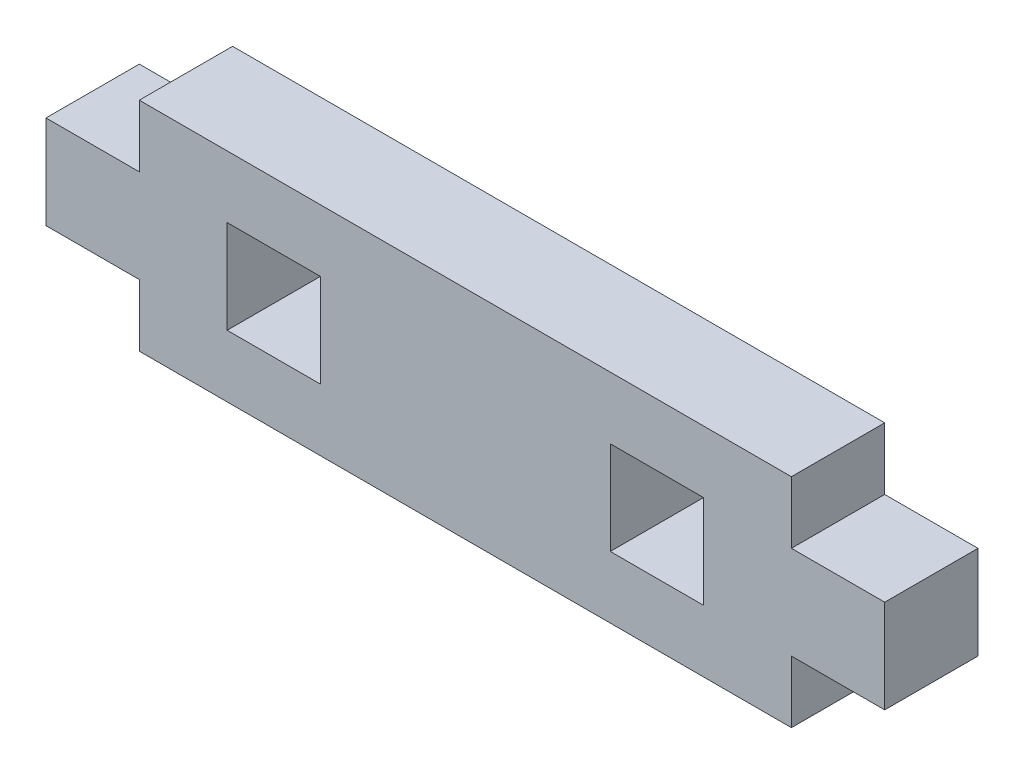
ISO-10303-21;
HEADER;
FILE_DESCRIPTION(('STEP AP214'),'2;1');
FILE_NAME('part.step','',(''),(''),'','','');
FILE_SCHEMA(('AUTOMOTIVE_DESIGN { 1 0 10303 214 1 1 1 1 }'));
ENDSEC;
DATA;
#1=APPLICATION_CONTEXT('core data for automotive mechanical design processes');
#2=APPLICATION_PROTOCOL_DEFINITION('international standard','automotive_design',2000,#1);
#3=PRODUCT_CONTEXT('',#1,'mechanical');
#4=PRODUCT('Part','Part','',(#3));
#5=PRODUCT_RELATED_PRODUCT_CATEGORY('part','',(#4));
#6=PRODUCT_DEFINITION_FORMATION('','',#4);
#7=PRODUCT_DEFINITION_CONTEXT('part definition',#1,'design');
#8=PRODUCT_DEFINITION('design','',#6,#7);
#9=PRODUCT_DEFINITION_SHAPE('','',#8);
#10=(LENGTH_UNIT() NAMED_UNIT(*) SI_UNIT(.MILLI.,.METRE.));
#11=(NAMED_UNIT(*) PLANE_ANGLE_UNIT() SI_UNIT($,.RADIAN.));
#12=(NAMED_UNIT(*) SI_UNIT($,.STERADIAN.) SOLID_ANGLE_UNIT());
#13=UNCERTAINTY_MEASURE_WITH_UNIT(LENGTH_MEASURE(1.E-05),#10,'distance_accuracy_value','');
#14=(GEOMETRIC_REPRESENTATION_CONTEXT(3) GLOBAL_UNCERTAINTY_ASSIGNED_CONTEXT((#13)) GLOBAL_UNIT_ASSIGNED_CONTEXT((#10,
#11,#12)) REPRESENTATION_CONTEXT('',''));
#15=CARTESIAN_POINT('',(0.,0.,0.));
#16=DIRECTION('',(0.,0.,1.));
#17=DIRECTION('',(1.,0.,0.));
#18=AXIS2_PLACEMENT_3D('',#15,#16,#17);
#19=CARTESIAN_POINT('',(5.15,3.425,5.15));
#20=DIRECTION('',(0.,1.,0.));
#21=DIRECTION('',(-1.,0.,0.));
#22=AXIS2_PLACEMENT_3D('',#19,#20,#21);
#23=PLANE('',#22);
#24=DIRECTION('',(1.,0.,0.));
#25=VECTOR('',#24,1.);
#26=CARTESIAN_POINT('',(5.15,3.425,0.));
#27=LINE('',#26,#25);
#28=CARTESIAN_POINT('',(0.,3.425,0.));
#29=VERTEX_POINT('',#28);
#30=CARTESIAN_POINT('',(5.15,3.425,0.));
#31=VERTEX_POINT('',#30);
#32=EDGE_CURVE('E231',#29,#31,#27,.T.);
#33=ORIENTED_EDGE('',*,*,#32,.T.);
#34=DIRECTION('',(0.,0.,-1.));
#35=VECTOR('',#34,1.);
#36=CARTESIAN_POINT('',(5.15,3.425,5.15));
#37=LINE('',#36,#35);
#38=CARTESIAN_POINT('',(5.15,3.425,5.15));
#39=VERTEX_POINT('',#38);
#40=EDGE_CURVE('E11',#39,#31,#37,.T.);
#41=ORIENTED_EDGE('',*,*,#40,.F.);
#42=DIRECTION('',(1.,0.,0.));
#43=VECTOR('',#42,1.);
#44=CARTESIAN_POINT('',(5.15,3.425,5.15));
#45=LINE('',#44,#43);
#46=CARTESIAN_POINT('',(0.,3.425,5.15));
#47=VERTEX_POINT('',#46);
#48=EDGE_CURVE('E238',#47,#39,#45,.T.);
#49=ORIENTED_EDGE('',*,*,#48,.F.);
#50=DIRECTION('',(0.,0.,-1.));
#51=VECTOR('',#50,1.);
#52=CARTESIAN_POINT('',(0.,3.425,5.15));
#53=LINE('',#52,#51);
#54=EDGE_CURVE('E264',#47,#29,#53,.T.);
#55=ORIENTED_EDGE('',*,*,#54,.T.);
#56=EDGE_LOOP('',(#33,#41,#49,#55));
#57=FACE_BOUND('',#56,.T.);
#58=ADVANCED_FACE('F33',(#57),#23,.F.);
#59=CARTESIAN_POINT('',(5.15,0.,5.15));
#60=DIRECTION('',(1.,0.,0.));
#61=DIRECTION('',(0.,1.,0.));
#62=AXIS2_PLACEMENT_3D('',#59,#60,#61);
#63=PLANE('',#62);
#64=DIRECTION('',(0.,-1.,0.));
#65=VECTOR('',#64,1.);
#66=CARTESIAN_POINT('',(5.15,0.,0.));
#67=LINE('',#66,#65);
#68=CARTESIAN_POINT('',(5.15,0.,0.));
#69=VERTEX_POINT('',#68);
#70=EDGE_CURVE('E267',#31,#69,#67,.T.);
#71=ORIENTED_EDGE('',*,*,#70,.T.);
#72=DIRECTION('',(0.,0.,-1.));
#73=VECTOR('',#72,1.);
#74=CARTESIAN_POINT('',(5.15,0.,5.15));
#75=LINE('',#74,#73);
#76=CARTESIAN_POINT('',(5.15,0.,5.15));
#77=VERTEX_POINT('',#76);
#78=EDGE_CURVE('E40',#77,#69,#75,.T.);
#79=ORIENTED_EDGE('',*,*,#78,.F.);
#80=DIRECTION('',(0.,-1.,0.));
#81=VECTOR('',#80,1.);
#82=CARTESIAN_POINT('',(5.15,0.,5.15));
#83=LINE('',#82,#81);
#84=EDGE_CURVE('E241',#39,#77,#83,.T.);
#85=ORIENTED_EDGE('',*,*,#84,.F.);
#86=ORIENTED_EDGE('',*,*,#40,.T.);
#87=EDGE_LOOP('',(#71,#79,#85,#86));
#88=FACE_BOUND('',#87,.T.);
#89=ADVANCED_FACE('F343',(#88),#63,.F.);
#90=CARTESIAN_POINT('',(5.15,0.,5.15));
#91=DIRECTION('',(0.,1.,0.));
#92=DIRECTION('',(0.,0.,1.));
#93=AXIS2_PLACEMENT_3D('',#90,#91,#92);
#94=PLANE('',#93);
#95=DIRECTION('',(1.,0.,0.));
#96=VECTOR('',#95,1.);
#97=CARTESIAN_POINT('',(5.15,0.,0.));
#98=LINE('',#97,#96);
#99=CARTESIAN_POINT('',(41.15,0.,0.));
#100=VERTEX_POINT('',#99);
#101=EDGE_CURVE('E269',#69,#100,#98,.T.);
#102=ORIENTED_EDGE('',*,*,#101,.T.);
#103=DIRECTION('',(0.,0.,-1.));
#104=VECTOR('',#103,1.);
#105=CARTESIAN_POINT('',(41.15,0.,5.15));
#106=LINE('',#105,#104);
#107=CARTESIAN_POINT('',(41.15,0.,5.15));
#108=VERTEX_POINT('',#107);
#109=EDGE_CURVE('E314',#108,#100,#106,.T.);
#110=ORIENTED_EDGE('',*,*,#109,.F.);
#111=DIRECTION('',(1.,0.,0.));
#112=VECTOR('',#111,1.);
#113=CARTESIAN_POINT('',(5.15,0.,5.15));
#114=LINE('',#113,#112);
#115=EDGE_CURVE('E244',#77,#108,#114,.T.);
#116=ORIENTED_EDGE('',*,*,#115,.F.);
#117=ORIENTED_EDGE('',*,*,#78,.T.);
#118=EDGE_LOOP('',(#102,#110,#116,#117));
#119=FACE_BOUND('',#118,.T.);
#120=ADVANCED_FACE('F321',(#119),#94,.F.);
#121=CARTESIAN_POINT('',(41.15,0.,5.15));
#122=DIRECTION('',(-1.,0.,0.));
#123=DIRECTION('',(0.,0.,1.));
#124=AXIS2_PLACEMENT_3D('',#121,#122,#123);
#125=PLANE('',#124);
#126=DIRECTION('',(0.,1.,0.));
#127=VECTOR('',#126,1.);
#128=CARTESIAN_POINT('',(41.15,0.,0.));
#129=LINE('',#128,#127);
#130=CARTESIAN_POINT('',(41.15,3.425,0.));
#131=VERTEX_POINT('',#130);
#132=EDGE_CURVE('E271',#100,#131,#129,.T.);
#133=ORIENTED_EDGE('',*,*,#132,.T.);
#134=DIRECTION('',(0.,0.,-1.));
#135=VECTOR('',#134,1.);
#136=CARTESIAN_POINT('',(41.15,3.425,5.15));
#137=LINE('',#136,#135);
#138=CARTESIAN_POINT('',(41.15,3.425,5.15));
#139=VERTEX_POINT('',#138);
#140=EDGE_CURVE('E311',#139,#131,#137,.T.);
#141=ORIENTED_EDGE('',*,*,#140,.F.);
#142=DIRECTION('',(0.,1.,0.));
#143=VECTOR('',#142,1.);
#144=CARTESIAN_POINT('',(41.15,0.,5.15));
#145=LINE('',#144,#143);
#146=EDGE_CURVE('E246',#108,#139,#145,.T.);
#147=ORIENTED_EDGE('',*,*,#146,.F.);
#148=ORIENTED_EDGE('',*,*,#109,.T.);
#149=EDGE_LOOP('',(#133,#141,#147,#148));
#150=FACE_BOUND('',#149,.T.);
#151=ADVANCED_FACE('F331',(#150),#125,.F.);
#152=CARTESIAN_POINT('',(46.3,3.425,5.15));
#153=DIRECTION('',(0.,1.,0.));
#154=DIRECTION('',(0.,0.,1.));
#155=AXIS2_PLACEMENT_3D('',#152,#153,#154);
#156=PLANE('',#155);
#157=DIRECTION('',(1.,0.,0.));
#158=VECTOR('',#157,1.);
#159=CARTESIAN_POINT('',(46.3,3.425,0.));
#160=LINE('',#159,#158);
#161=CARTESIAN_POINT('',(46.3,3.425,0.));
#162=VERTEX_POINT('',#161);
#163=EDGE_CURVE('E273',#131,#162,#160,.T.);
#164=ORIENTED_EDGE('',*,*,#163,.T.);
#165=DIRECTION('',(0.,0.,-1.));
#166=VECTOR('',#165,1.);
#167=CARTESIAN_POINT('',(46.3,3.425,5.15));
#168=LINE('',#167,#166);
#169=CARTESIAN_POINT('',(46.3,3.425,5.15));
#170=VERTEX_POINT('',#169);
#171=EDGE_CURVE('E308',#170,#162,#168,.T.);
#172=ORIENTED_EDGE('',*,*,#171,.F.);
#173=DIRECTION('',(1.,0.,0.));
#174=VECTOR('',#173,1.);
#175=CARTESIAN_POINT('',(46.3,3.425,5.15));
#176=LINE('',#175,#174);
#177=EDGE_CURVE('E248',#139,#170,#176,.T.);
#178=ORIENTED_EDGE('',*,*,#177,.F.);
#179=ORIENTED_EDGE('',*,*,#140,.T.);
#180=EDGE_LOOP('',(#164,#172,#178,#179));
#181=FACE_BOUND('',#180,.T.);
#182=ADVANCED_FACE('F335',(#181),#156,.F.);
#183=CARTESIAN_POINT('',(46.3,8.575,5.15));
#184=DIRECTION('',(-1.,0.,0.));
#185=DIRECTION('',(0.,0.,1.));
#186=AXIS2_PLACEMENT_3D('',#183,#184,#185);
#187=PLANE('',#186);
#188=DIRECTION('',(0.,1.,0.));
#189=VECTOR('',#188,1.);
#190=CARTESIAN_POINT('',(46.3,8.575,0.));
#191=LINE('',#190,#189);
#192=CARTESIAN_POINT('',(46.3,8.575,0.));
#193=VERTEX_POINT('',#192);
#194=EDGE_CURVE('E275',#162,#193,#191,.T.);
#195=ORIENTED_EDGE('',*,*,#194,.T.);
#196=DIRECTION('',(0.,0.,-1.));
#197=VECTOR('',#196,1.);
#198=CARTESIAN_POINT('',(46.3,8.575,5.15));
#199=LINE('',#198,#197);
#200=CARTESIAN_POINT('',(46.3,8.575,5.15));
#201=VERTEX_POINT('',#200);
#202=EDGE_CURVE('E305',#201,#193,#199,.T.);
#203=ORIENTED_EDGE('',*,*,#202,.F.);
#204=DIRECTION('',(0.,1.,0.));
#205=VECTOR('',#204,1.);
#206=CARTESIAN_POINT('',(46.3,8.575,5.15));
#207=LINE('',#206,#205);
#208=EDGE_CURVE('E250',#170,#201,#207,.T.);
#209=ORIENTED_EDGE('',*,*,#208,.F.);
#210=ORIENTED_EDGE('',*,*,#171,.T.);
#211=EDGE_LOOP('',(#195,#203,#209,#210));
#212=FACE_BOUND('',#211,.T.);
#213=ADVANCED_FACE('F376',(#212),#187,.F.);
#214=CARTESIAN_POINT('',(41.15,8.575,5.15));
#215=DIRECTION('',(0.,-1.,0.));
#216=DIRECTION('',(1.,0.,0.));
#217=AXIS2_PLACEMENT_3D('',#214,#215,#216);
#218=PLANE('',#217);
#219=DIRECTION('',(-1.,0.,0.));
#220=VECTOR('',#219,1.);
#221=CARTESIAN_POINT('',(41.15,8.575,0.));
#222=LINE('',#221,#220);
#223=CARTESIAN_POINT('',(41.15,8.575,0.));
#224=VERTEX_POINT('',#223);
#225=EDGE_CURVE('E277',#193,#224,#222,.T.);
#226=ORIENTED_EDGE('',*,*,#225,.T.);
#227=DIRECTION('',(0.,0.,-1.));
#228=VECTOR('',#227,1.);
#229=CARTESIAN_POINT('',(41.15,8.575,5.15));
#230=LINE('',#229,#228);
#231=CARTESIAN_POINT('',(41.15,8.575,5.15));
#232=VERTEX_POINT('',#231);
#233=EDGE_CURVE('E302',#232,#224,#230,.T.);
#234=ORIENTED_EDGE('',*,*,#233,.F.);
#235=DIRECTION('',(-1.,0.,0.));
#236=VECTOR('',#235,1.);
#237=CARTESIAN_POINT('',(41.15,8.575,5.15));
#238=LINE('',#237,#236);
#239=EDGE_CURVE('E252',#201,#232,#238,.T.);
#240=ORIENTED_EDGE('',*,*,#239,.F.);
#241=ORIENTED_EDGE('',*,*,#202,.T.);
#242=EDGE_LOOP('',(#226,#234,#240,#241));
#243=FACE_BOUND('',#242,.T.);
#244=ADVANCED_FACE('F374',(#243),#218,.F.);
#245=CARTESIAN_POINT('',(41.15,8.575,5.15));
#246=DIRECTION('',(-1.,0.,0.));
#247=DIRECTION('',(0.,0.,1.));
#248=AXIS2_PLACEMENT_3D('',#245,#246,#247);
#249=PLANE('',#248);
#250=DIRECTION('',(0.,1.,0.));
#251=VECTOR('',#250,1.);
#252=CARTESIAN_POINT('',(41.15,8.575,0.));
#253=LINE('',#252,#251);
#254=CARTESIAN_POINT('',(41.15,12.,0.));
#255=VERTEX_POINT('',#254);
#256=EDGE_CURVE('E279',#224,#255,#253,.T.);
#257=ORIENTED_EDGE('',*,*,#256,.T.);
#258=DIRECTION('',(0.,0.,-1.));
#259=VECTOR('',#258,1.);
#260=CARTESIAN_POINT('',(41.15,12.,5.15));
#261=LINE('',#260,#259);
#262=CARTESIAN_POINT('',(41.15,12.,5.15));
#263=VERTEX_POINT('',#262);
#264=EDGE_CURVE('E299',#263,#255,#261,.T.);
#265=ORIENTED_EDGE('',*,*,#264,.F.);
#266=DIRECTION('',(0.,1.,0.));
#267=VECTOR('',#266,1.);
#268=CARTESIAN_POINT('',(41.15,8.575,5.15));
#269=LINE('',#268,#267);
#270=EDGE_CURVE('E254',#232,#263,#269,.T.);
#271=ORIENTED_EDGE('',*,*,#270,.F.);
#272=ORIENTED_EDGE('',*,*,#233,.T.);
#273=EDGE_LOOP('',(#257,#265,#271,#272));
#274=FACE_BOUND('',#273,.T.);
#275=ADVANCED_FACE('F370',(#274),#249,.F.);
#276=CARTESIAN_POINT('',(41.15,12.,5.15));
#277=DIRECTION('',(0.,-1.,0.));
#278=DIRECTION('',(0.,0.,-1.));
#279=AXIS2_PLACEMENT_3D('',#276,#277,#278);
#280=PLANE('',#279);
#281=DIRECTION('',(-1.,0.,0.));
#282=VECTOR('',#281,1.);
#283=CARTESIAN_POINT('',(41.15,12.,0.));
#284=LINE('',#283,#282);
#285=CARTESIAN_POINT('',(5.15000000000002,12.,0.));
#286=VERTEX_POINT('',#285);
#287=EDGE_CURVE('E281',#255,#286,#284,.T.);
#288=ORIENTED_EDGE('',*,*,#287,.T.);
#289=DIRECTION('',(0.,0.,-1.));
#290=VECTOR('',#289,1.);
#291=CARTESIAN_POINT('',(5.15000000000002,12.,5.15));
#292=LINE('',#291,#290);
#293=CARTESIAN_POINT('',(5.15000000000002,12.,5.15));
#294=VERTEX_POINT('',#293);
#295=EDGE_CURVE('E296',#294,#286,#292,.T.);
#296=ORIENTED_EDGE('',*,*,#295,.F.);
#297=DIRECTION('',(-1.,0.,0.));
#298=VECTOR('',#297,1.);
#299=CARTESIAN_POINT('',(41.15,12.,5.15));
#300=LINE('',#299,#298);
#301=EDGE_CURVE('E256',#263,#294,#300,.T.);
#302=ORIENTED_EDGE('',*,*,#301,.F.);
#303=ORIENTED_EDGE('',*,*,#264,.T.);
#304=EDGE_LOOP('',(#288,#296,#302,#303));
#305=FACE_BOUND('',#304,.T.);
#306=ADVANCED_FACE('F365',(#305),#280,.F.);
#307=CARTESIAN_POINT('',(5.15,8.575,5.15));
#308=DIRECTION('',(1.,0.,0.));
#309=DIRECTION('',(0.,1.,0.));
#310=AXIS2_PLACEMENT_3D('',#307,#308,#309);
#311=PLANE('',#310);
#312=DIRECTION('',(0.,-1.,0.));
#313=VECTOR('',#312,1.);
#314=CARTESIAN_POINT('',(5.15,8.575,0.));
#315=LINE('',#314,#313);
#316=CARTESIAN_POINT('',(5.15,8.575,0.));
#317=VERTEX_POINT('',#316);
#318=EDGE_CURVE('E283',#286,#317,#315,.T.);
#319=ORIENTED_EDGE('',*,*,#318,.T.);
#320=DIRECTION('',(0.,0.,-1.));
#321=VECTOR('',#320,1.);
#322=CARTESIAN_POINT('',(5.15,8.575,5.15));
#323=LINE('',#322,#321);
#324=CARTESIAN_POINT('',(5.15,8.575,5.15));
#325=VERTEX_POINT('',#324);
#326=EDGE_CURVE('E293',#325,#317,#323,.T.);
#327=ORIENTED_EDGE('',*,*,#326,.F.);
#328=DIRECTION('',(0.,-1.,0.));
#329=VECTOR('',#328,1.);
#330=CARTESIAN_POINT('',(5.15,8.575,5.15));
#331=LINE('',#330,#329);
#332=EDGE_CURVE('E258',#294,#325,#331,.T.);
#333=ORIENTED_EDGE('',*,*,#332,.F.);
#334=ORIENTED_EDGE('',*,*,#295,.T.);
#335=EDGE_LOOP('',(#319,#327,#333,#334));
#336=FACE_BOUND('',#335,.T.);
#337=ADVANCED_FACE('F359',(#336),#311,.F.);
#338=CARTESIAN_POINT('',(0.,8.575,5.15));
#339=DIRECTION('',(0.,-1.,0.));
#340=DIRECTION('',(0.,0.,-1.));
#341=AXIS2_PLACEMENT_3D('',#338,#339,#340);
#342=PLANE('',#341);
#343=DIRECTION('',(-1.,0.,0.));
#344=VECTOR('',#343,1.);
#345=CARTESIAN_POINT('',(0.,8.575,0.));
#346=LINE('',#345,#344);
#347=CARTESIAN_POINT('',(0.,8.575,0.));
#348=VERTEX_POINT('',#347);
#349=EDGE_CURVE('E285',#317,#348,#346,.T.);
#350=ORIENTED_EDGE('',*,*,#349,.T.);
#351=DIRECTION('',(0.,0.,-1.));
#352=VECTOR('',#351,1.);
#353=CARTESIAN_POINT('',(0.,8.575,5.15));
#354=LINE('',#353,#352);
#355=CARTESIAN_POINT('',(0.,8.575,5.15));
#356=VERTEX_POINT('',#355);
#357=EDGE_CURVE('E290',#356,#348,#354,.T.);
#358=ORIENTED_EDGE('',*,*,#357,.F.);
#359=DIRECTION('',(-1.,0.,0.));
#360=VECTOR('',#359,1.);
#361=CARTESIAN_POINT('',(0.,8.575,5.15));
#362=LINE('',#361,#360);
#363=EDGE_CURVE('E260',#325,#356,#362,.T.);
#364=ORIENTED_EDGE('',*,*,#363,.F.);
#365=ORIENTED_EDGE('',*,*,#326,.T.);
#366=EDGE_LOOP('',(#350,#358,#364,#365));
#367=FACE_BOUND('',#366,.T.);
#368=ADVANCED_FACE('F355',(#367),#342,.F.);
#369=CARTESIAN_POINT('',(0.,3.425,5.15));
#370=DIRECTION('',(1.,0.,0.));
#371=DIRECTION('',(0.,1.,0.));
#372=AXIS2_PLACEMENT_3D('',#369,#370,#371);
#373=PLANE('',#372);
#374=DIRECTION('',(0.,-1.,0.));
#375=VECTOR('',#374,1.);
#376=CARTESIAN_POINT('',(0.,3.425,0.));
#377=LINE('',#376,#375);
#378=EDGE_CURVE('E242',#348,#29,#377,.T.);
#379=ORIENTED_EDGE('',*,*,#378,.T.);
#380=ORIENTED_EDGE('',*,*,#54,.F.);
#381=DIRECTION('',(0.,-1.,0.));
#382=VECTOR('',#381,1.);
#383=CARTESIAN_POINT('',(0.,3.425,5.15));
#384=LINE('',#383,#382);
#385=EDGE_CURVE('E262',#356,#47,#384,.T.);
#386=ORIENTED_EDGE('',*,*,#385,.F.);
#387=ORIENTED_EDGE('',*,*,#357,.T.);
#388=EDGE_LOOP('',(#379,#380,#386,#387));
#389=FACE_BOUND('',#388,.T.);
#390=ADVANCED_FACE('F350',(#389),#373,.F.);
#391=CARTESIAN_POINT('',(0.,0.,5.15));
#392=DIRECTION('',(0.,0.,-1.));
#393=DIRECTION('',(-1.,0.,0.));
#394=AXIS2_PLACEMENT_3D('',#391,#392,#393);
#395=PLANE('',#394);
#396=DIRECTION('',(1.,0.,0.));
#397=VECTOR('',#396,1.);
#398=CARTESIAN_POINT('',(31.15,3.425,5.15));
#399=LINE('',#398,#397);
#400=CARTESIAN_POINT('',(31.15,3.425,5.15));
#401=VERTEX_POINT('',#400);
#402=CARTESIAN_POINT('',(36.3,3.425,5.15));
#403=VERTEX_POINT('',#402);
#404=EDGE_CURVE('E196',#401,#403,#399,.T.);
#405=ORIENTED_EDGE('',*,*,#404,.F.);
#406=DIRECTION('',(0.,-1.,0.));
#407=VECTOR('',#406,1.);
#408=CARTESIAN_POINT('',(31.15,8.575,5.15));
#409=LINE('',#408,#407);
#410=CARTESIAN_POINT('',(31.15,8.575,5.15));
#411=VERTEX_POINT('',#410);
#412=EDGE_CURVE('E47',#411,#401,#409,.T.);
#413=ORIENTED_EDGE('',*,*,#412,.F.);
#414=DIRECTION('',(-1.,0.,0.));
#415=VECTOR('',#414,1.);
#416=CARTESIAN_POINT('',(31.15,8.575,5.15));
#417=LINE('',#416,#415);
#418=CARTESIAN_POINT('',(36.3,8.575,5.15));
#419=VERTEX_POINT('',#418);
#420=EDGE_CURVE('E187',#419,#411,#417,.T.);
#421=ORIENTED_EDGE('',*,*,#420,.F.);
#422=DIRECTION('',(0.,1.,0.));
#423=VECTOR('',#422,1.);
#424=CARTESIAN_POINT('',(36.3,8.575,5.15));
#425=LINE('',#424,#423);
#426=EDGE_CURVE('E190',#403,#419,#425,.T.);
#427=ORIENTED_EDGE('',*,*,#426,.F.);
#428=EDGE_LOOP('',(#405,#413,#421,#427));
#429=FACE_BOUND('',#428,.T.);
#430=DIRECTION('',(0.,-1.,0.));
#431=VECTOR('',#430,1.);
#432=CARTESIAN_POINT('',(10.,8.575,5.15));
#433=LINE('',#432,#431);
#434=CARTESIAN_POINT('',(10.,8.575,5.15));
#435=VERTEX_POINT('',#434);
#436=CARTESIAN_POINT('',(10.,3.425,5.15));
#437=VERTEX_POINT('',#436);
#438=EDGE_CURVE('E221',#435,#437,#433,.T.);
#439=ORIENTED_EDGE('',*,*,#438,.F.);
#440=DIRECTION('',(-1.,0.,0.));
#441=VECTOR('',#440,1.);
#442=CARTESIAN_POINT('',(15.15,8.575,5.15));
#443=LINE('',#442,#441);
#444=CARTESIAN_POINT('',(15.15,8.575,5.15));
#445=VERTEX_POINT('',#444);
#446=EDGE_CURVE('E202',#445,#435,#443,.T.);
#447=ORIENTED_EDGE('',*,*,#446,.F.);
#448=DIRECTION('',(0.,1.,0.));
#449=VECTOR('',#448,1.);
#450=CARTESIAN_POINT('',(15.15,8.575,5.15));
#451=LINE('',#450,#449);
#452=CARTESIAN_POINT('',(15.15,3.425,5.15));
#453=VERTEX_POINT('',#452);
#454=EDGE_CURVE('E210',#453,#445,#451,.T.);
#455=ORIENTED_EDGE('',*,*,#454,.F.);
#456=DIRECTION('',(1.,0.,0.));
#457=VECTOR('',#456,1.);
#458=CARTESIAN_POINT('',(15.15,3.425,5.15));
#459=LINE('',#458,#457);
#460=EDGE_CURVE('E224',#437,#453,#459,.T.);
#461=ORIENTED_EDGE('',*,*,#460,.F.);
#462=EDGE_LOOP('',(#439,#447,#455,#461));
#463=FACE_BOUND('',#462,.T.);
#464=ORIENTED_EDGE('',*,*,#48,.T.);
#465=ORIENTED_EDGE('',*,*,#84,.T.);
#466=ORIENTED_EDGE('',*,*,#115,.T.);
#467=ORIENTED_EDGE('',*,*,#146,.T.);
#468=ORIENTED_EDGE('',*,*,#177,.T.);
#469=ORIENTED_EDGE('',*,*,#208,.T.);
#470=ORIENTED_EDGE('',*,*,#239,.T.);
#471=ORIENTED_EDGE('',*,*,#270,.T.);
#472=ORIENTED_EDGE('',*,*,#301,.T.);
#473=ORIENTED_EDGE('',*,*,#332,.T.);
#474=ORIENTED_EDGE('',*,*,#363,.T.);
#475=ORIENTED_EDGE('',*,*,#385,.T.);
#476=EDGE_LOOP('',(#464,#465,#466,#467,#468,#469,#470,#471,#472,#473,#474,#475));
#477=FACE_BOUND('',#476,.T.);
#478=ADVANCED_FACE('F339',(#429,#463,#477),#395,.F.);
#479=CARTESIAN_POINT('',(0.,0.,0.));
#480=DIRECTION('',(0.,0.,-1.));
#481=DIRECTION('',(-1.,0.,0.));
#482=AXIS2_PLACEMENT_3D('',#479,#480,#481);
#483=PLANE('',#482);
#484=DIRECTION('',(0.,-1.,0.));
#485=VECTOR('',#484,1.);
#486=CARTESIAN_POINT('',(31.15,8.575,0.));
#487=LINE('',#486,#485);
#488=CARTESIAN_POINT('',(31.15,8.575,0.));
#489=VERTEX_POINT('',#488);
#490=CARTESIAN_POINT('',(31.15,3.425,0.));
#491=VERTEX_POINT('',#490);
#492=EDGE_CURVE('E171',#489,#491,#487,.T.);
#493=ORIENTED_EDGE('',*,*,#492,.T.);
#494=DIRECTION('',(1.,0.,0.));
#495=VECTOR('',#494,1.);
#496=CARTESIAN_POINT('',(31.15,3.425,0.));
#497=LINE('',#496,#495);
#498=CARTESIAN_POINT('',(36.3,3.425,0.));
#499=VERTEX_POINT('',#498);
#500=EDGE_CURVE('E180',#491,#499,#497,.T.);
#501=ORIENTED_EDGE('',*,*,#500,.T.);
#502=DIRECTION('',(0.,1.,0.));
#503=VECTOR('',#502,1.);
#504=CARTESIAN_POINT('',(36.3,8.575,0.));
#505=LINE('',#504,#503);
#506=CARTESIAN_POINT('',(36.3,8.575,0.));
#507=VERTEX_POINT('',#506);
#508=EDGE_CURVE('E55',#499,#507,#505,.T.);
#509=ORIENTED_EDGE('',*,*,#508,.T.);
#510=DIRECTION('',(-1.,0.,0.));
#511=VECTOR('',#510,1.);
#512=CARTESIAN_POINT('',(31.15,8.575,0.));
#513=LINE('',#512,#511);
#514=EDGE_CURVE('E177',#507,#489,#513,.T.);
#515=ORIENTED_EDGE('',*,*,#514,.T.);
#516=EDGE_LOOP('',(#493,#501,#509,#515));
#517=FACE_BOUND('',#516,.T.);
#518=DIRECTION('',(-1.,0.,0.));
#519=VECTOR('',#518,1.);
#520=CARTESIAN_POINT('',(15.15,8.575,0.));
#521=LINE('',#520,#519);
#522=CARTESIAN_POINT('',(15.15,8.575,0.));
#523=VERTEX_POINT('',#522);
#524=CARTESIAN_POINT('',(10.,8.575,0.));
#525=VERTEX_POINT('',#524);
#526=EDGE_CURVE('E206',#523,#525,#521,.T.);
#527=ORIENTED_EDGE('',*,*,#526,.T.);
#528=DIRECTION('',(0.,-1.,0.));
#529=VECTOR('',#528,1.);
#530=CARTESIAN_POINT('',(10.,8.575,0.));
#531=LINE('',#530,#529);
#532=CARTESIAN_POINT('',(10.,3.425,0.));
#533=VERTEX_POINT('',#532);
#534=EDGE_CURVE('E209',#525,#533,#531,.T.);
#535=ORIENTED_EDGE('',*,*,#534,.T.);
#536=DIRECTION('',(1.,0.,0.));
#537=VECTOR('',#536,1.);
#538=CARTESIAN_POINT('',(15.15,3.425,0.));
#539=LINE('',#538,#537);
#540=CARTESIAN_POINT('',(15.15,3.425,0.));
#541=VERTEX_POINT('',#540);
#542=EDGE_CURVE('E213',#533,#541,#539,.T.);
#543=ORIENTED_EDGE('',*,*,#542,.T.);
#544=DIRECTION('',(0.,1.,0.));
#545=VECTOR('',#544,1.);
#546=CARTESIAN_POINT('',(15.15,8.575,0.));
#547=LINE('',#546,#545);
#548=EDGE_CURVE('E216',#541,#523,#547,.T.);
#549=ORIENTED_EDGE('',*,*,#548,.T.);
#550=EDGE_LOOP('',(#527,#535,#543,#549));
#551=FACE_BOUND('',#550,.T.);
#552=ORIENTED_EDGE('',*,*,#32,.F.);
#553=ORIENTED_EDGE('',*,*,#378,.F.);
#554=ORIENTED_EDGE('',*,*,#349,.F.);
#555=ORIENTED_EDGE('',*,*,#318,.F.);
#556=ORIENTED_EDGE('',*,*,#287,.F.);
#557=ORIENTED_EDGE('',*,*,#256,.F.);
#558=ORIENTED_EDGE('',*,*,#225,.F.);
#559=ORIENTED_EDGE('',*,*,#194,.F.);
#560=ORIENTED_EDGE('',*,*,#163,.F.);
#561=ORIENTED_EDGE('',*,*,#132,.F.);
#562=ORIENTED_EDGE('',*,*,#101,.F.);
#563=ORIENTED_EDGE('',*,*,#70,.F.);
#564=EDGE_LOOP('',(#552,#553,#554,#555,#556,#557,#558,#559,#560,#561,#562,#563));
#565=FACE_BOUND('',#564,.T.);
#566=ADVANCED_FACE('F184',(#517,#551,#565),#483,.T.);
#567=CARTESIAN_POINT('',(15.15,8.575,0.));
#568=DIRECTION('',(0.,1.,0.));
#569=DIRECTION('',(-1.,0.,0.));
#570=AXIS2_PLACEMENT_3D('',#567,#568,#569);
#571=PLANE('',#570);
#572=ORIENTED_EDGE('',*,*,#446,.T.);
#573=DIRECTION('',(0.,0.,1.));
#574=VECTOR('',#573,1.);
#575=CARTESIAN_POINT('',(10.,8.575,0.));
#576=LINE('',#575,#574);
#577=EDGE_CURVE('E219',#525,#435,#576,.T.);
#578=ORIENTED_EDGE('',*,*,#577,.F.);
#579=ORIENTED_EDGE('',*,*,#526,.F.);
#580=DIRECTION('',(0.,0.,1.));
#581=VECTOR('',#580,1.);
#582=CARTESIAN_POINT('',(15.15,8.575,0.));
#583=LINE('',#582,#581);
#584=EDGE_CURVE('E229',#523,#445,#583,.T.);
#585=ORIENTED_EDGE('',*,*,#584,.T.);
#586=EDGE_LOOP('',(#572,#578,#579,#585));
#587=FACE_BOUND('',#586,.T.);
#588=ADVANCED_FACE('F471',(#587),#571,.F.);
#589=CARTESIAN_POINT('',(15.15,8.575,0.));
#590=DIRECTION('',(1.,0.,0.));
#591=DIRECTION('',(0.,0.,-1.));
#592=AXIS2_PLACEMENT_3D('',#589,#590,#591);
#593=PLANE('',#592);
#594=ORIENTED_EDGE('',*,*,#454,.T.);
#595=ORIENTED_EDGE('',*,*,#584,.F.);
#596=ORIENTED_EDGE('',*,*,#548,.F.);
#597=DIRECTION('',(0.,0.,1.));
#598=VECTOR('',#597,1.);
#599=CARTESIAN_POINT('',(15.15,3.425,0.));
#600=LINE('',#599,#598);
#601=EDGE_CURVE('E232',#541,#453,#600,.T.);
#602=ORIENTED_EDGE('',*,*,#601,.T.);
#603=EDGE_LOOP('',(#594,#595,#596,#602));
#604=FACE_BOUND('',#603,.T.);
#605=ADVANCED_FACE('F480',(#604),#593,.F.);
#606=CARTESIAN_POINT('',(15.15,3.425,0.));
#607=DIRECTION('',(0.,-1.,0.));
#608=DIRECTION('',(1.,0.,0.));
#609=AXIS2_PLACEMENT_3D('',#606,#607,#608);
#610=PLANE('',#609);
#611=ORIENTED_EDGE('',*,*,#460,.T.);
#612=ORIENTED_EDGE('',*,*,#601,.F.);
#613=ORIENTED_EDGE('',*,*,#542,.F.);
#614=DIRECTION('',(0.,0.,1.));
#615=VECTOR('',#614,1.);
#616=CARTESIAN_POINT('',(10.,3.425,0.));
#617=LINE('',#616,#615);
#618=EDGE_CURVE('E234',#533,#437,#617,.T.);
#619=ORIENTED_EDGE('',*,*,#618,.T.);
#620=EDGE_LOOP('',(#611,#612,#613,#619));
#621=FACE_BOUND('',#620,.T.);
#622=ADVANCED_FACE('F490',(#621),#610,.F.);
#623=CARTESIAN_POINT('',(10.,8.575,0.));
#624=DIRECTION('',(-1.,0.,0.));
#625=DIRECTION('',(0.,-1.,0.));
#626=AXIS2_PLACEMENT_3D('',#623,#624,#625);
#627=PLANE('',#626);
#628=ORIENTED_EDGE('',*,*,#438,.T.);
#629=ORIENTED_EDGE('',*,*,#618,.F.);
#630=ORIENTED_EDGE('',*,*,#534,.F.);
#631=ORIENTED_EDGE('',*,*,#577,.T.);
#632=EDGE_LOOP('',(#628,#629,#630,#631));
#633=FACE_BOUND('',#632,.T.);
#634=ADVANCED_FACE('F500',(#633),#627,.F.);
#635=CARTESIAN_POINT('',(31.15,8.575,0.));
#636=DIRECTION('',(-1.,0.,0.));
#637=DIRECTION('',(0.,-1.,0.));
#638=AXIS2_PLACEMENT_3D('',#635,#636,#637);
#639=PLANE('',#638);
#640=ORIENTED_EDGE('',*,*,#412,.T.);
#641=DIRECTION('',(0.,0.,1.));
#642=VECTOR('',#641,1.);
#643=CARTESIAN_POINT('',(31.15,3.425,0.));
#644=LINE('',#643,#642);
#645=EDGE_CURVE('E167',#491,#401,#644,.T.);
#646=ORIENTED_EDGE('',*,*,#645,.F.);
#647=ORIENTED_EDGE('',*,*,#492,.F.);
#648=DIRECTION('',(0.,0.,1.));
#649=VECTOR('',#648,1.);
#650=CARTESIAN_POINT('',(31.15,8.575,0.));
#651=LINE('',#650,#649);
#652=EDGE_CURVE('E200',#489,#411,#651,.T.);
#653=ORIENTED_EDGE('',*,*,#652,.T.);
#654=EDGE_LOOP('',(#640,#646,#647,#653));
#655=FACE_BOUND('',#654,.T.);
#656=ADVANCED_FACE('F169',(#655),#639,.F.);
#657=CARTESIAN_POINT('',(31.15,8.575,0.));
#658=DIRECTION('',(0.,1.,0.));
#659=DIRECTION('',(0.,0.,1.));
#660=AXIS2_PLACEMENT_3D('',#657,#658,#659);
#661=PLANE('',#660);
#662=ORIENTED_EDGE('',*,*,#420,.T.);
#663=ORIENTED_EDGE('',*,*,#652,.F.);
#664=ORIENTED_EDGE('',*,*,#514,.F.);
#665=DIRECTION('',(0.,0.,1.));
#666=VECTOR('',#665,1.);
#667=CARTESIAN_POINT('',(36.3,8.575,0.));
#668=LINE('',#667,#666);
#669=EDGE_CURVE('E203',#507,#419,#668,.T.);
#670=ORIENTED_EDGE('',*,*,#669,.T.);
#671=EDGE_LOOP('',(#662,#663,#664,#670));
#672=FACE_BOUND('',#671,.T.);
#673=ADVANCED_FACE('F519',(#672),#661,.F.);
#674=CARTESIAN_POINT('',(36.3,8.575,0.));
#675=DIRECTION('',(1.,0.,0.));
#676=DIRECTION('',(0.,0.,-1.));
#677=AXIS2_PLACEMENT_3D('',#674,#675,#676);
#678=PLANE('',#677);
#679=ORIENTED_EDGE('',*,*,#426,.T.);
#680=ORIENTED_EDGE('',*,*,#669,.F.);
#681=ORIENTED_EDGE('',*,*,#508,.F.);
#682=DIRECTION('',(0.,0.,1.));
#683=VECTOR('',#682,1.);
#684=CARTESIAN_POINT('',(36.3,3.425,0.));
#685=LINE('',#684,#683);
#686=EDGE_CURVE('E176',#499,#403,#685,.T.);
#687=ORIENTED_EDGE('',*,*,#686,.T.);
#688=EDGE_LOOP('',(#679,#680,#681,#687));
#689=FACE_BOUND('',#688,.T.);
#690=ADVANCED_FACE('F528',(#689),#678,.F.);
#691=CARTESIAN_POINT('',(31.15,3.425,0.));
#692=DIRECTION('',(0.,-1.,0.));
#693=DIRECTION('',(1.,0.,0.));
#694=AXIS2_PLACEMENT_3D('',#691,#692,#693);
#695=PLANE('',#694);
#696=ORIENTED_EDGE('',*,*,#404,.T.);
#697=ORIENTED_EDGE('',*,*,#686,.F.);
#698=ORIENTED_EDGE('',*,*,#500,.F.);
#699=ORIENTED_EDGE('',*,*,#645,.T.);
#700=EDGE_LOOP('',(#696,#697,#698,#699));
#701=FACE_BOUND('',#700,.T.);
#702=ADVANCED_FACE('F181',(#701),#695,.F.);
#703=CLOSED_SHELL('',(#58,#89,#120,#151,#182,#213,#244,#275,#306,#337,#368,#390,#478,#566,#588,
#605,#622,#634,#656,#673,#690,#702));
#704=MANIFOLD_SOLID_BREP('B2',#703);
#705=ADVANCED_BREP_SHAPE_REPRESENTATION('',(#18,#704),#14);
#706=SHAPE_DEFINITION_REPRESENTATION(#9,#705);
ENDSEC;
END-ISO-10303-21;
